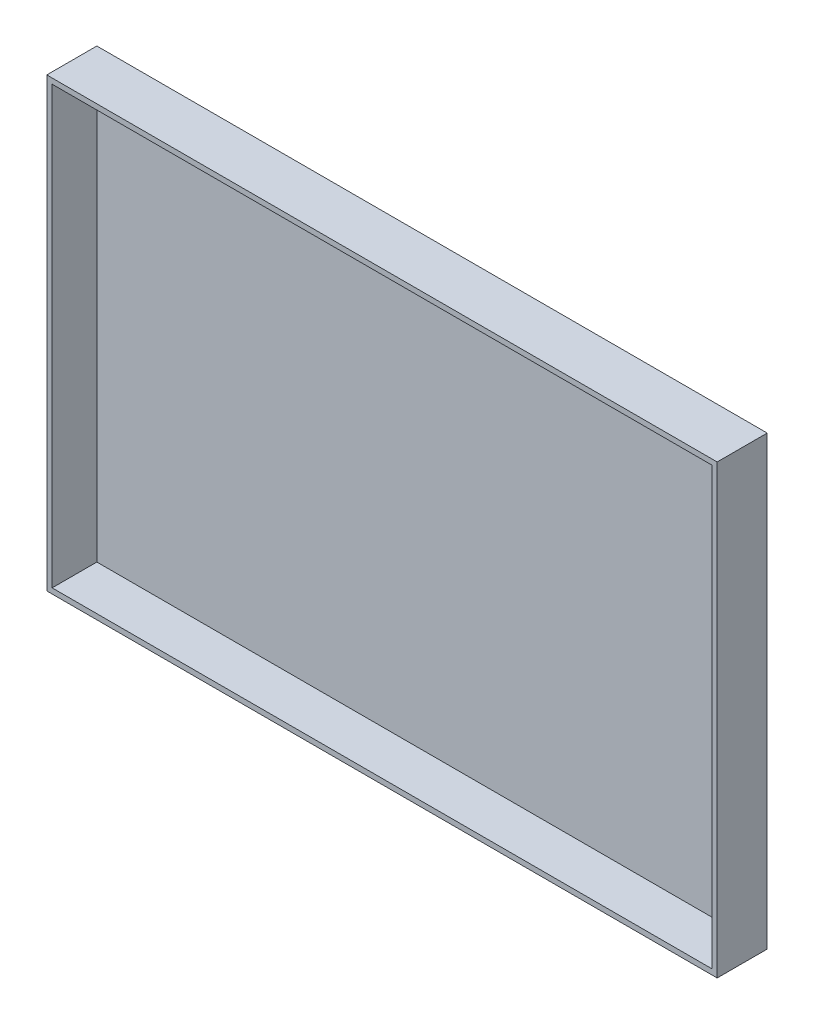
ISO-10303-21;
HEADER;
FILE_DESCRIPTION(('STEP AP214'),'2;1');
FILE_NAME('part.step','',(''),(''),'','','');
FILE_SCHEMA(('AUTOMOTIVE_DESIGN { 1 0 10303 214 1 1 1 1 }'));
ENDSEC;
DATA;
#1=APPLICATION_CONTEXT('core data for automotive mechanical design processes');
#2=APPLICATION_PROTOCOL_DEFINITION('international standard','automotive_design',2000,#1);
#3=PRODUCT_CONTEXT('',#1,'mechanical');
#4=PRODUCT('Part','Part','',(#3));
#5=PRODUCT_RELATED_PRODUCT_CATEGORY('part','',(#4));
#6=PRODUCT_DEFINITION_FORMATION('','',#4);
#7=PRODUCT_DEFINITION_CONTEXT('part definition',#1,'design');
#8=PRODUCT_DEFINITION('design','',#6,#7);
#9=PRODUCT_DEFINITION_SHAPE('','',#8);
#10=(LENGTH_UNIT() NAMED_UNIT(*) SI_UNIT(.MILLI.,.METRE.));
#11=(NAMED_UNIT(*) PLANE_ANGLE_UNIT() SI_UNIT($,.RADIAN.));
#12=(NAMED_UNIT(*) SI_UNIT($,.STERADIAN.) SOLID_ANGLE_UNIT());
#13=UNCERTAINTY_MEASURE_WITH_UNIT(LENGTH_MEASURE(1.E-05),#10,'distance_accuracy_value','');
#14=(GEOMETRIC_REPRESENTATION_CONTEXT(3) GLOBAL_UNCERTAINTY_ASSIGNED_CONTEXT((#13)) GLOBAL_UNIT_ASSIGNED_CONTEXT((#10,
#11,#12)) REPRESENTATION_CONTEXT('',''));
#15=CARTESIAN_POINT('',(0.,0.,0.));
#16=DIRECTION('',(0.,0.,1.));
#17=DIRECTION('',(1.,0.,0.));
#18=AXIS2_PLACEMENT_3D('',#15,#16,#17);
#19=CARTESIAN_POINT('',(-186.396374910565,66.4285714285714,1.2));
#20=DIRECTION('',(1.,0.,0.));
#21=DIRECTION('',(0.,0.,-1.));
#22=AXIS2_PLACEMENT_3D('',#19,#20,#21);
#23=PLANE('',#22);
#24=DIRECTION('',(0.,-1.,0.));
#25=VECTOR('',#24,1.);
#26=CARTESIAN_POINT('',(-186.396374910565,66.4285714285714,0.));
#27=LINE('',#26,#25);
#28=CARTESIAN_POINT('',(-186.396374910565,66.4285714285714,0.));
#29=VERTEX_POINT('',#28);
#30=CARTESIAN_POINT('',(-186.396374910565,-33.5714285714286,0.));
#31=VERTEX_POINT('',#30);
#32=EDGE_CURVE('E144',#29,#31,#27,.T.);
#33=ORIENTED_EDGE('',*,*,#32,.T.);
#34=DIRECTION('',(0.,0.,-1.));
#35=VECTOR('',#34,1.);
#36=CARTESIAN_POINT('',(-186.396374910565,-33.5714285714286,1.2));
#37=LINE('',#36,#35);
#38=CARTESIAN_POINT('',(-186.396374910565,-33.5714285714286,11.2));
#39=VERTEX_POINT('',#38);
#40=EDGE_CURVE('E11',#39,#31,#37,.T.);
#41=ORIENTED_EDGE('',*,*,#40,.F.);
#42=DIRECTION('',(0.,-1.,0.));
#43=VECTOR('',#42,1.);
#44=CARTESIAN_POINT('',(-186.396374910565,66.4285714285714,11.2));
#45=LINE('',#44,#43);
#46=CARTESIAN_POINT('',(-186.396374910565,66.4285714285714,11.2));
#47=VERTEX_POINT('',#46);
#48=EDGE_CURVE('E111',#47,#39,#45,.T.);
#49=ORIENTED_EDGE('',*,*,#48,.F.);
#50=DIRECTION('',(0.,0.,-1.));
#51=VECTOR('',#50,1.);
#52=CARTESIAN_POINT('',(-186.396374910565,66.4285714285714,1.2));
#53=LINE('',#52,#51);
#54=EDGE_CURVE('E153',#47,#29,#53,.T.);
#55=ORIENTED_EDGE('',*,*,#54,.T.);
#56=EDGE_LOOP('',(#33,#41,#49,#55));
#57=FACE_BOUND('',#56,.T.);
#58=ADVANCED_FACE('F33',(#57),#23,.F.);
#59=CARTESIAN_POINT('',(-186.396374910565,-33.5714285714286,1.2));
#60=DIRECTION('',(0.,1.,0.));
#61=DIRECTION('',(0.,0.,1.));
#62=AXIS2_PLACEMENT_3D('',#59,#60,#61);
#63=PLANE('',#62);
#64=DIRECTION('',(1.,0.,0.));
#65=VECTOR('',#64,1.);
#66=CARTESIAN_POINT('',(-186.396374910565,-33.5714285714286,0.));
#67=LINE('',#66,#65);
#68=CARTESIAN_POINT('',(-36.3963749105652,-33.5714285714286,0.));
#69=VERTEX_POINT('',#68);
#70=EDGE_CURVE('E147',#31,#69,#67,.T.);
#71=ORIENTED_EDGE('',*,*,#70,.T.);
#72=DIRECTION('',(0.,0.,-1.));
#73=VECTOR('',#72,1.);
#74=CARTESIAN_POINT('',(-36.3963749105652,-33.5714285714286,1.2));
#75=LINE('',#74,#73);
#76=CARTESIAN_POINT('',(-36.3963749105652,-33.5714285714286,11.2));
#77=VERTEX_POINT('',#76);
#78=EDGE_CURVE('E40',#77,#69,#75,.T.);
#79=ORIENTED_EDGE('',*,*,#78,.F.);
#80=DIRECTION('',(1.,0.,0.));
#81=VECTOR('',#80,1.);
#82=CARTESIAN_POINT('',(-186.396374910565,-33.5714285714286,11.2));
#83=LINE('',#82,#81);
#84=EDGE_CURVE('E135',#39,#77,#83,.T.);
#85=ORIENTED_EDGE('',*,*,#84,.F.);
#86=ORIENTED_EDGE('',*,*,#40,.T.);
#87=EDGE_LOOP('',(#71,#79,#85,#86));
#88=FACE_BOUND('',#87,.T.);
#89=ADVANCED_FACE('F175',(#88),#63,.F.);
#90=CARTESIAN_POINT('',(-36.3963749105652,66.4285714285714,1.2));
#91=DIRECTION('',(-1.,0.,0.));
#92=DIRECTION('',(0.,-1.,0.));
#93=AXIS2_PLACEMENT_3D('',#90,#91,#92);
#94=PLANE('',#93);
#95=DIRECTION('',(0.,1.,0.));
#96=VECTOR('',#95,1.);
#97=CARTESIAN_POINT('',(-36.3963749105652,66.4285714285714,0.));
#98=LINE('',#97,#96);
#99=CARTESIAN_POINT('',(-36.3963749105652,66.4285714285714,0.));
#100=VERTEX_POINT('',#99);
#101=EDGE_CURVE('E149',#69,#100,#98,.T.);
#102=ORIENTED_EDGE('',*,*,#101,.T.);
#103=DIRECTION('',(0.,0.,-1.));
#104=VECTOR('',#103,1.);
#105=CARTESIAN_POINT('',(-36.3963749105652,66.4285714285714,1.2));
#106=LINE('',#105,#104);
#107=CARTESIAN_POINT('',(-36.3963749105652,66.4285714285714,11.2));
#108=VERTEX_POINT('',#107);
#109=EDGE_CURVE('E156',#108,#100,#106,.T.);
#110=ORIENTED_EDGE('',*,*,#109,.F.);
#111=DIRECTION('',(0.,1.,0.));
#112=VECTOR('',#111,1.);
#113=CARTESIAN_POINT('',(-36.3963749105652,66.4285714285714,11.2));
#114=LINE('',#113,#112);
#115=EDGE_CURVE('E138',#77,#108,#114,.T.);
#116=ORIENTED_EDGE('',*,*,#115,.F.);
#117=ORIENTED_EDGE('',*,*,#78,.T.);
#118=EDGE_LOOP('',(#102,#110,#116,#117));
#119=FACE_BOUND('',#118,.T.);
#120=ADVANCED_FACE('F162',(#119),#94,.F.);
#121=CARTESIAN_POINT('',(-186.396374910565,66.4285714285714,1.2));
#122=DIRECTION('',(0.,-1.,0.));
#123=DIRECTION('',(0.,0.,-1.));
#124=AXIS2_PLACEMENT_3D('',#121,#122,#123);
#125=PLANE('',#124);
#126=DIRECTION('',(-1.,0.,0.));
#127=VECTOR('',#126,1.);
#128=CARTESIAN_POINT('',(-186.396374910565,66.4285714285714,0.));
#129=LINE('',#128,#127);
#130=EDGE_CURVE('E151',#100,#29,#129,.T.);
#131=ORIENTED_EDGE('',*,*,#130,.T.);
#132=ORIENTED_EDGE('',*,*,#54,.F.);
#133=DIRECTION('',(-1.,0.,0.));
#134=VECTOR('',#133,1.);
#135=CARTESIAN_POINT('',(-186.396374910565,66.4285714285714,11.2));
#136=LINE('',#135,#134);
#137=EDGE_CURVE('E141',#108,#47,#136,.T.);
#138=ORIENTED_EDGE('',*,*,#137,.F.);
#139=ORIENTED_EDGE('',*,*,#109,.T.);
#140=EDGE_LOOP('',(#131,#132,#138,#139));
#141=FACE_BOUND('',#140,.T.);
#142=ADVANCED_FACE('F170',(#141),#125,.F.);
#143=CARTESIAN_POINT('',(0.,0.,0.));
#144=DIRECTION('',(0.,0.,1.));
#145=DIRECTION('',(1.,0.,0.));
#146=AXIS2_PLACEMENT_3D('',#143,#144,#145);
#147=PLANE('',#146);
#148=ORIENTED_EDGE('',*,*,#32,.F.);
#149=ORIENTED_EDGE('',*,*,#130,.F.);
#150=ORIENTED_EDGE('',*,*,#101,.F.);
#151=ORIENTED_EDGE('',*,*,#70,.F.);
#152=EDGE_LOOP('',(#148,#149,#150,#151));
#153=FACE_BOUND('',#152,.T.);
#154=ADVANCED_FACE('F168',(#153),#147,.F.);
#155=CARTESIAN_POINT('',(0.,0.,11.2));
#156=DIRECTION('',(0.,0.,1.));
#157=DIRECTION('',(1.,0.,0.));
#158=AXIS2_PLACEMENT_3D('',#155,#156,#157);
#159=PLANE('',#158);
#160=ORIENTED_EDGE('',*,*,#48,.T.);
#161=ORIENTED_EDGE('',*,*,#84,.T.);
#162=ORIENTED_EDGE('',*,*,#115,.T.);
#163=ORIENTED_EDGE('',*,*,#137,.T.);
#164=EDGE_LOOP('',(#160,#161,#162,#163));
#165=FACE_BOUND('',#164,.T.);
#166=DIRECTION('',(1.,0.,0.));
#167=VECTOR('',#166,1.);
#168=CARTESIAN_POINT('',(-185.196374910565,-32.3714285714286,11.2));
#169=LINE('',#168,#167);
#170=CARTESIAN_POINT('',(-185.196374910565,-32.3714285714286,11.2));
#171=VERTEX_POINT('',#170);
#172=CARTESIAN_POINT('',(-37.5963749105652,-32.3714285714286,11.2));
#173=VERTEX_POINT('',#172);
#174=EDGE_CURVE('E105',#171,#173,#169,.T.);
#175=ORIENTED_EDGE('',*,*,#174,.F.);
#176=DIRECTION('',(0.,-1.,0.));
#177=VECTOR('',#176,1.);
#178=CARTESIAN_POINT('',(-185.196374910565,65.2285714285714,11.2));
#179=LINE('',#178,#177);
#180=CARTESIAN_POINT('',(-185.196374910565,65.2285714285714,11.2));
#181=VERTEX_POINT('',#180);
#182=EDGE_CURVE('E96',#181,#171,#179,.T.);
#183=ORIENTED_EDGE('',*,*,#182,.F.);
#184=DIRECTION('',(-1.,0.,0.));
#185=VECTOR('',#184,1.);
#186=CARTESIAN_POINT('',(-185.196374910565,65.2285714285714,11.2));
#187=LINE('',#186,#185);
#188=CARTESIAN_POINT('',(-37.5963749105652,65.2285714285714,11.2));
#189=VERTEX_POINT('',#188);
#190=EDGE_CURVE('E119',#189,#181,#187,.T.);
#191=ORIENTED_EDGE('',*,*,#190,.F.);
#192=DIRECTION('',(0.,1.,0.));
#193=VECTOR('',#192,1.);
#194=CARTESIAN_POINT('',(-37.5963749105652,65.2285714285714,11.2));
#195=LINE('',#194,#193);
#196=EDGE_CURVE('E117',#173,#189,#195,.T.);
#197=ORIENTED_EDGE('',*,*,#196,.F.);
#198=EDGE_LOOP('',(#175,#183,#191,#197));
#199=FACE_BOUND('',#198,.T.);
#200=ADVANCED_FACE('F115',(#165,#199),#159,.T.);
#201=CARTESIAN_POINT('',(-185.196374910565,65.2285714285714,11.2));
#202=DIRECTION('',(1.,0.,0.));
#203=DIRECTION('',(0.,0.,-1.));
#204=AXIS2_PLACEMENT_3D('',#201,#202,#203);
#205=PLANE('',#204);
#206=DIRECTION('',(0.,-1.,0.));
#207=VECTOR('',#206,1.);
#208=CARTESIAN_POINT('',(-185.196374910565,65.2285714285714,1.2));
#209=LINE('',#208,#207);
#210=CARTESIAN_POINT('',(-185.196374910565,65.2285714285714,1.2));
#211=VERTEX_POINT('',#210);
#212=CARTESIAN_POINT('',(-185.196374910565,-32.3714285714286,1.2));
#213=VERTEX_POINT('',#212);
#214=EDGE_CURVE('E47',#211,#213,#209,.T.);
#215=ORIENTED_EDGE('',*,*,#214,.F.);
#216=DIRECTION('',(0.,0.,-1.));
#217=VECTOR('',#216,1.);
#218=CARTESIAN_POINT('',(-185.196374910565,65.2285714285714,11.2));
#219=LINE('',#218,#217);
#220=EDGE_CURVE('E101',#181,#211,#219,.T.);
#221=ORIENTED_EDGE('',*,*,#220,.F.);
#222=ORIENTED_EDGE('',*,*,#182,.T.);
#223=DIRECTION('',(0.,0.,-1.));
#224=VECTOR('',#223,1.);
#225=CARTESIAN_POINT('',(-185.196374910565,-32.3714285714286,11.2));
#226=LINE('',#225,#224);
#227=EDGE_CURVE('E99',#171,#213,#226,.T.);
#228=ORIENTED_EDGE('',*,*,#227,.T.);
#229=EDGE_LOOP('',(#215,#221,#222,#228));
#230=FACE_BOUND('',#229,.T.);
#231=ADVANCED_FACE('F98',(#230),#205,.T.);
#232=CARTESIAN_POINT('',(-185.196374910565,-32.3714285714286,11.2));
#233=DIRECTION('',(0.,1.,0.));
#234=DIRECTION('',(0.,0.,1.));
#235=AXIS2_PLACEMENT_3D('',#232,#233,#234);
#236=PLANE('',#235);
#237=DIRECTION('',(1.,0.,0.));
#238=VECTOR('',#237,1.);
#239=CARTESIAN_POINT('',(-185.196374910565,-32.3714285714286,1.2));
#240=LINE('',#239,#238);
#241=CARTESIAN_POINT('',(-37.5963749105652,-32.3714285714286,1.2));
#242=VERTEX_POINT('',#241);
#243=EDGE_CURVE('E51',#213,#242,#240,.T.);
#244=ORIENTED_EDGE('',*,*,#243,.F.);
#245=ORIENTED_EDGE('',*,*,#227,.F.);
#246=ORIENTED_EDGE('',*,*,#174,.T.);
#247=DIRECTION('',(0.,0.,-1.));
#248=VECTOR('',#247,1.);
#249=CARTESIAN_POINT('',(-37.5963749105652,-32.3714285714286,11.2));
#250=LINE('',#249,#248);
#251=EDGE_CURVE('E112',#173,#242,#250,.T.);
#252=ORIENTED_EDGE('',*,*,#251,.T.);
#253=EDGE_LOOP('',(#244,#245,#246,#252));
#254=FACE_BOUND('',#253,.T.);
#255=ADVANCED_FACE('F109',(#254),#236,.T.);
#256=CARTESIAN_POINT('',(-37.5963749105652,65.2285714285714,11.2));
#257=DIRECTION('',(-1.,0.,0.));
#258=DIRECTION('',(0.,0.,1.));
#259=AXIS2_PLACEMENT_3D('',#256,#257,#258);
#260=PLANE('',#259);
#261=DIRECTION('',(0.,1.,0.));
#262=VECTOR('',#261,1.);
#263=CARTESIAN_POINT('',(-37.5963749105652,65.2285714285714,1.2));
#264=LINE('',#263,#262);
#265=CARTESIAN_POINT('',(-37.5963749105652,65.2285714285714,1.2));
#266=VERTEX_POINT('',#265);
#267=EDGE_CURVE('E125',#242,#266,#264,.T.);
#268=ORIENTED_EDGE('',*,*,#267,.F.);
#269=ORIENTED_EDGE('',*,*,#251,.F.);
#270=ORIENTED_EDGE('',*,*,#196,.T.);
#271=DIRECTION('',(0.,0.,-1.));
#272=VECTOR('',#271,1.);
#273=CARTESIAN_POINT('',(-37.5963749105652,65.2285714285714,11.2));
#274=LINE('',#273,#272);
#275=EDGE_CURVE('E129',#189,#266,#274,.T.);
#276=ORIENTED_EDGE('',*,*,#275,.T.);
#277=EDGE_LOOP('',(#268,#269,#270,#276));
#278=FACE_BOUND('',#277,.T.);
#279=ADVANCED_FACE('F197',(#278),#260,.T.);
#280=CARTESIAN_POINT('',(-185.196374910565,65.2285714285714,11.2));
#281=DIRECTION('',(0.,-1.,0.));
#282=DIRECTION('',(0.,0.,-1.));
#283=AXIS2_PLACEMENT_3D('',#280,#281,#282);
#284=PLANE('',#283);
#285=DIRECTION('',(-1.,0.,0.));
#286=VECTOR('',#285,1.);
#287=CARTESIAN_POINT('',(-185.196374910565,65.2285714285714,1.2));
#288=LINE('',#287,#286);
#289=EDGE_CURVE('E106',#266,#211,#288,.T.);
#290=ORIENTED_EDGE('',*,*,#289,.F.);
#291=ORIENTED_EDGE('',*,*,#275,.F.);
#292=ORIENTED_EDGE('',*,*,#190,.T.);
#293=ORIENTED_EDGE('',*,*,#220,.T.);
#294=EDGE_LOOP('',(#290,#291,#292,#293));
#295=FACE_BOUND('',#294,.T.);
#296=ADVANCED_FACE('F190',(#295),#284,.T.);
#297=CARTESIAN_POINT('',(0.,0.,1.2));
#298=DIRECTION('',(0.,0.,1.));
#299=DIRECTION('',(1.,0.,0.));
#300=AXIS2_PLACEMENT_3D('',#297,#298,#299);
#301=PLANE('',#300);
#302=ORIENTED_EDGE('',*,*,#214,.T.);
#303=ORIENTED_EDGE('',*,*,#243,.T.);
#304=ORIENTED_EDGE('',*,*,#267,.T.);
#305=ORIENTED_EDGE('',*,*,#289,.T.);
#306=EDGE_LOOP('',(#302,#303,#304,#305));
#307=FACE_BOUND('',#306,.T.);
#308=ADVANCED_FACE('F187',(#307),#301,.T.);
#309=CLOSED_SHELL('',(#58,#89,#120,#142,#154,#200,#231,#255,#279,#296,#308));
#310=MANIFOLD_SOLID_BREP('B2',#309);
#311=ADVANCED_BREP_SHAPE_REPRESENTATION('',(#18,#310),#14);
#312=SHAPE_DEFINITION_REPRESENTATION(#9,#311);
ENDSEC;
END-ISO-10303-21;
